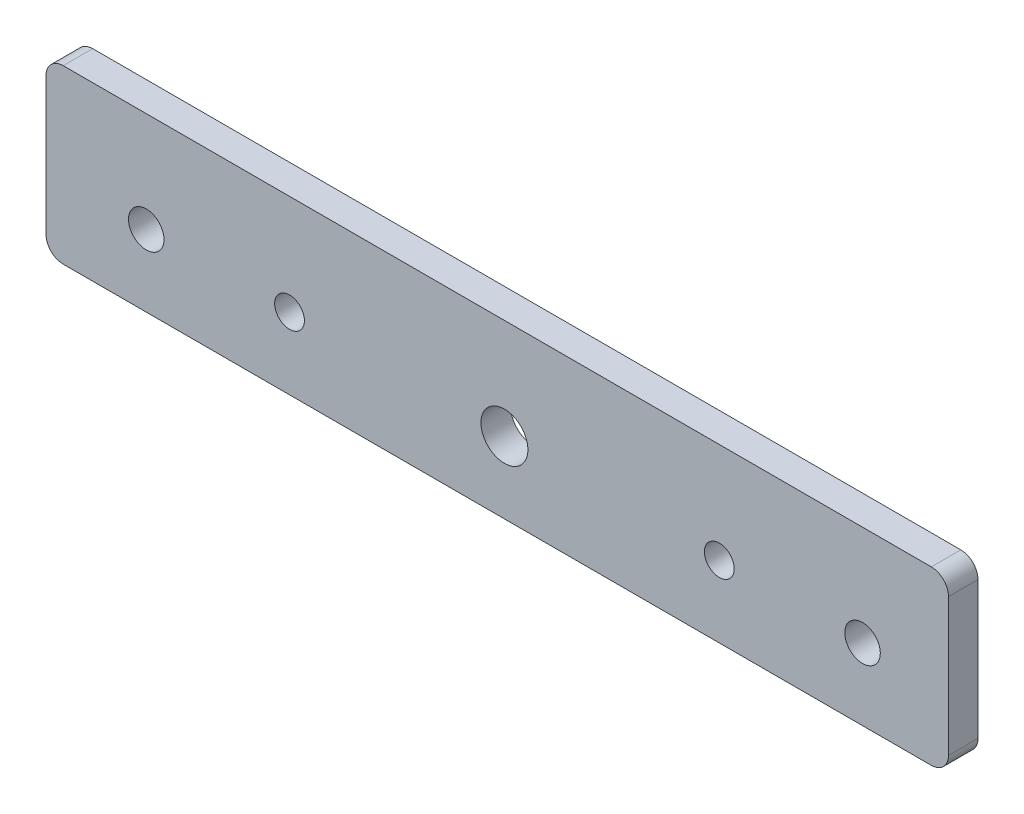
ISO-10303-21;
HEADER;
FILE_DESCRIPTION(('STEP AP214'),'2;1');
FILE_NAME('part.step','',(''),(''),'','','');
FILE_SCHEMA(('AUTOMOTIVE_DESIGN { 1 0 10303 214 1 1 1 1 }'));
ENDSEC;
DATA;
#1=APPLICATION_CONTEXT('core data for automotive mechanical design processes');
#2=APPLICATION_PROTOCOL_DEFINITION('international standard','automotive_design',2000,#1);
#3=PRODUCT_CONTEXT('',#1,'mechanical');
#4=PRODUCT('Part','Part','',(#3));
#5=PRODUCT_RELATED_PRODUCT_CATEGORY('part','',(#4));
#6=PRODUCT_DEFINITION_FORMATION('','',#4);
#7=PRODUCT_DEFINITION_CONTEXT('part definition',#1,'design');
#8=PRODUCT_DEFINITION('design','',#6,#7);
#9=PRODUCT_DEFINITION_SHAPE('','',#8);
#10=(LENGTH_UNIT() NAMED_UNIT(*) SI_UNIT(.MILLI.,.METRE.));
#11=(NAMED_UNIT(*) PLANE_ANGLE_UNIT() SI_UNIT($,.RADIAN.));
#12=(NAMED_UNIT(*) SI_UNIT($,.STERADIAN.) SOLID_ANGLE_UNIT());
#13=UNCERTAINTY_MEASURE_WITH_UNIT(LENGTH_MEASURE(1.E-05),#10,'distance_accuracy_value','');
#14=(GEOMETRIC_REPRESENTATION_CONTEXT(3) GLOBAL_UNCERTAINTY_ASSIGNED_CONTEXT((#13)) GLOBAL_UNIT_ASSIGNED_CONTEXT((#10,
#11,#12)) REPRESENTATION_CONTEXT('',''));
#15=CARTESIAN_POINT('',(0.,0.,0.));
#16=DIRECTION('',(0.,0.,1.));
#17=DIRECTION('',(1.,0.,0.));
#18=AXIS2_PLACEMENT_3D('',#15,#16,#17);
#19=CARTESIAN_POINT('',(0.,17.5,5.15));
#20=DIRECTION('',(0.,1.,0.));
#21=DIRECTION('',(0.,0.,1.));
#22=AXIS2_PLACEMENT_3D('',#19,#20,#21);
#23=PLANE('',#22);
#24=DIRECTION('',(1.,0.,0.));
#25=VECTOR('',#24,1.);
#26=CARTESIAN_POINT('',(0.,17.5,0.));
#27=LINE('',#26,#25);
#28=CARTESIAN_POINT('',(-77.,17.5,0.));
#29=VERTEX_POINT('',#28);
#30=CARTESIAN_POINT('',(74.5,17.5,0.));
#31=VERTEX_POINT('',#30);
#32=EDGE_CURVE('E147',#29,#31,#27,.T.);
#33=ORIENTED_EDGE('',*,*,#32,.F.);
#34=DIRECTION('',(0.,0.,-1.));
#35=VECTOR('',#34,1.);
#36=CARTESIAN_POINT('',(-77.,17.5,5.15));
#37=LINE('',#36,#35);
#38=CARTESIAN_POINT('',(-77.,17.5,5.15));
#39=VERTEX_POINT('',#38);
#40=EDGE_CURVE('E11',#39,#29,#37,.T.);
#41=ORIENTED_EDGE('',*,*,#40,.F.);
#42=DIRECTION('',(1.,0.,0.));
#43=VECTOR('',#42,1.);
#44=CARTESIAN_POINT('',(0.,17.5,5.15));
#45=LINE('',#44,#43);
#46=CARTESIAN_POINT('',(74.5,17.5,5.15));
#47=VERTEX_POINT('',#46);
#48=EDGE_CURVE('E195',#39,#47,#45,.T.);
#49=ORIENTED_EDGE('',*,*,#48,.T.);
#50=DIRECTION('',(0.,0.,-1.));
#51=VECTOR('',#50,1.);
#52=CARTESIAN_POINT('',(74.5,17.5,5.15));
#53=LINE('',#52,#51);
#54=EDGE_CURVE('E88',#47,#31,#53,.T.);
#55=ORIENTED_EDGE('',*,*,#54,.T.);
#56=EDGE_LOOP('',(#33,#41,#49,#55));
#57=FACE_BOUND('',#56,.T.);
#58=ADVANCED_FACE('F37',(#57),#23,.T.);
#59=CARTESIAN_POINT('',(-77.,14.5,5.15));
#60=DIRECTION('',(0.,0.,-1.));
#61=DIRECTION('',(-1.,0.,0.));
#62=AXIS2_PLACEMENT_3D('',#59,#60,#61);
#63=CYLINDRICAL_SURFACE('',#62,3.);
#64=CARTESIAN_POINT('',(-77.,14.5,0.));
#65=DIRECTION('',(0.,0.,1.));
#66=DIRECTION('',(1.,0.,0.));
#67=AXIS2_PLACEMENT_3D('',#64,#65,#66);
#68=CIRCLE('',#67,3.);
#69=CARTESIAN_POINT('',(-80.,14.5,0.));
#70=VERTEX_POINT('',#69);
#71=EDGE_CURVE('E150',#29,#70,#68,.T.);
#72=ORIENTED_EDGE('',*,*,#71,.T.);
#73=DIRECTION('',(0.,0.,-1.));
#74=VECTOR('',#73,1.);
#75=CARTESIAN_POINT('',(-80.,14.5,5.15));
#76=LINE('',#75,#74);
#77=CARTESIAN_POINT('',(-80.,14.5,5.15));
#78=VERTEX_POINT('',#77);
#79=EDGE_CURVE('E46',#78,#70,#76,.T.);
#80=ORIENTED_EDGE('',*,*,#79,.F.);
#81=CARTESIAN_POINT('',(-77.,14.5,5.15));
#82=DIRECTION('',(0.,0.,1.));
#83=DIRECTION('',(1.,0.,0.));
#84=AXIS2_PLACEMENT_3D('',#81,#82,#83);
#85=CIRCLE('',#84,3.);
#86=EDGE_CURVE('E192',#39,#78,#85,.T.);
#87=ORIENTED_EDGE('',*,*,#86,.F.);
#88=ORIENTED_EDGE('',*,*,#40,.T.);
#89=EDGE_LOOP('',(#72,#80,#87,#88));
#90=FACE_BOUND('',#89,.T.);
#91=ADVANCED_FACE('F183',(#90),#63,.T.);
#92=CARTESIAN_POINT('',(-80.,0.,5.15));
#93=DIRECTION('',(-1.,0.,0.));
#94=DIRECTION('',(0.,0.,1.));
#95=AXIS2_PLACEMENT_3D('',#92,#93,#94);
#96=PLANE('',#95);
#97=DIRECTION('',(0.,1.,0.));
#98=VECTOR('',#97,1.);
#99=CARTESIAN_POINT('',(-80.,0.,0.));
#100=LINE('',#99,#98);
#101=CARTESIAN_POINT('',(-80.,-9.5,0.));
#102=VERTEX_POINT('',#101);
#103=EDGE_CURVE('E153',#102,#70,#100,.T.);
#104=ORIENTED_EDGE('',*,*,#103,.F.);
#105=DIRECTION('',(0.,0.,-1.));
#106=VECTOR('',#105,1.);
#107=CARTESIAN_POINT('',(-80.,-9.5,5.15));
#108=LINE('',#107,#106);
#109=CARTESIAN_POINT('',(-80.,-9.5,5.15));
#110=VERTEX_POINT('',#109);
#111=EDGE_CURVE('E173',#110,#102,#108,.T.);
#112=ORIENTED_EDGE('',*,*,#111,.F.);
#113=DIRECTION('',(0.,1.,0.));
#114=VECTOR('',#113,1.);
#115=CARTESIAN_POINT('',(-80.,0.,5.15));
#116=LINE('',#115,#114);
#117=EDGE_CURVE('E180',#110,#78,#116,.T.);
#118=ORIENTED_EDGE('',*,*,#117,.T.);
#119=ORIENTED_EDGE('',*,*,#79,.T.);
#120=EDGE_LOOP('',(#104,#112,#118,#119));
#121=FACE_BOUND('',#120,.T.);
#122=ADVANCED_FACE('F178',(#121),#96,.T.);
#123=CARTESIAN_POINT('',(-77.,-9.5,5.15));
#124=DIRECTION('',(0.,0.,-1.));
#125=DIRECTION('',(-1.,0.,0.));
#126=AXIS2_PLACEMENT_3D('',#123,#124,#125);
#127=CYLINDRICAL_SURFACE('',#126,3.);
#128=CARTESIAN_POINT('',(-77.,-9.5,0.));
#129=DIRECTION('',(0.,0.,1.));
#130=DIRECTION('',(1.,0.,0.));
#131=AXIS2_PLACEMENT_3D('',#128,#129,#130);
#132=CIRCLE('',#131,3.);
#133=CARTESIAN_POINT('',(-77.,-12.5,0.));
#134=VERTEX_POINT('',#133);
#135=EDGE_CURVE('E156',#134,#102,#132,.F.);
#136=ORIENTED_EDGE('',*,*,#135,.F.);
#137=DIRECTION('',(0.,0.,-1.));
#138=VECTOR('',#137,1.);
#139=CARTESIAN_POINT('',(-77.,-12.5,5.15));
#140=LINE('',#139,#138);
#141=CARTESIAN_POINT('',(-77.,-12.5,5.15));
#142=VERTEX_POINT('',#141);
#143=EDGE_CURVE('E171',#142,#134,#140,.T.);
#144=ORIENTED_EDGE('',*,*,#143,.F.);
#145=CARTESIAN_POINT('',(-77.,-9.5,5.15));
#146=DIRECTION('',(0.,0.,1.));
#147=DIRECTION('',(1.,0.,0.));
#148=AXIS2_PLACEMENT_3D('',#145,#146,#147);
#149=CIRCLE('',#148,3.);
#150=EDGE_CURVE('E191',#142,#110,#149,.F.);
#151=ORIENTED_EDGE('',*,*,#150,.T.);
#152=ORIENTED_EDGE('',*,*,#111,.T.);
#153=EDGE_LOOP('',(#136,#144,#151,#152));
#154=FACE_BOUND('',#153,.T.);
#155=ADVANCED_FACE('F189',(#154),#127,.T.);
#156=CARTESIAN_POINT('',(0.,-12.5,5.15));
#157=DIRECTION('',(0.,1.,0.));
#158=DIRECTION('',(0.,0.,1.));
#159=AXIS2_PLACEMENT_3D('',#156,#157,#158);
#160=PLANE('',#159);
#161=DIRECTION('',(1.,0.,0.));
#162=VECTOR('',#161,1.);
#163=CARTESIAN_POINT('',(0.,-12.5,0.));
#164=LINE('',#163,#162);
#165=CARTESIAN_POINT('',(74.5,-12.5,0.));
#166=VERTEX_POINT('',#165);
#167=EDGE_CURVE('E159',#134,#166,#164,.T.);
#168=ORIENTED_EDGE('',*,*,#167,.T.);
#169=DIRECTION('',(0.,0.,-1.));
#170=VECTOR('',#169,1.);
#171=CARTESIAN_POINT('',(74.5,-12.5,5.15));
#172=LINE('',#171,#170);
#173=CARTESIAN_POINT('',(74.5,-12.5,5.15));
#174=VERTEX_POINT('',#173);
#175=EDGE_CURVE('E125',#174,#166,#172,.T.);
#176=ORIENTED_EDGE('',*,*,#175,.F.);
#177=DIRECTION('',(1.,0.,0.));
#178=VECTOR('',#177,1.);
#179=CARTESIAN_POINT('',(0.,-12.5,5.15));
#180=LINE('',#179,#178);
#181=EDGE_CURVE('E113',#142,#174,#180,.T.);
#182=ORIENTED_EDGE('',*,*,#181,.F.);
#183=ORIENTED_EDGE('',*,*,#143,.T.);
#184=EDGE_LOOP('',(#168,#176,#182,#183));
#185=FACE_BOUND('',#184,.T.);
#186=ADVANCED_FACE('F280',(#185),#160,.F.);
#187=CARTESIAN_POINT('',(74.5,-9.5,5.15));
#188=DIRECTION('',(0.,0.,-1.));
#189=DIRECTION('',(-1.,0.,0.));
#190=AXIS2_PLACEMENT_3D('',#187,#188,#189);
#191=CYLINDRICAL_SURFACE('',#190,3.00000000000001);
#192=CARTESIAN_POINT('',(74.5,-9.5,0.));
#193=DIRECTION('',(0.,0.,1.));
#194=DIRECTION('',(1.,0.,0.));
#195=AXIS2_PLACEMENT_3D('',#192,#193,#194);
#196=CIRCLE('',#195,3.00000000000001);
#197=CARTESIAN_POINT('',(77.5,-9.5,0.));
#198=VERTEX_POINT('',#197);
#199=EDGE_CURVE('E121',#166,#198,#196,.T.);
#200=ORIENTED_EDGE('',*,*,#199,.T.);
#201=DIRECTION('',(0.,0.,-1.));
#202=VECTOR('',#201,1.);
#203=CARTESIAN_POINT('',(77.5,-9.5,5.15));
#204=LINE('',#203,#202);
#205=CARTESIAN_POINT('',(77.5,-9.5,5.15));
#206=VERTEX_POINT('',#205);
#207=EDGE_CURVE('E119',#206,#198,#204,.T.);
#208=ORIENTED_EDGE('',*,*,#207,.F.);
#209=CARTESIAN_POINT('',(74.5,-9.5,5.15));
#210=DIRECTION('',(0.,0.,1.));
#211=DIRECTION('',(1.,0.,0.));
#212=AXIS2_PLACEMENT_3D('',#209,#210,#211);
#213=CIRCLE('',#212,3.00000000000001);
#214=EDGE_CURVE('E106',#174,#206,#213,.T.);
#215=ORIENTED_EDGE('',*,*,#214,.F.);
#216=ORIENTED_EDGE('',*,*,#175,.T.);
#217=EDGE_LOOP('',(#200,#208,#215,#216));
#218=FACE_BOUND('',#217,.T.);
#219=ADVANCED_FACE('F120',(#218),#191,.T.);
#220=CARTESIAN_POINT('',(77.5,0.,5.15));
#221=DIRECTION('',(1.,0.,0.));
#222=DIRECTION('',(0.,0.,-1.));
#223=AXIS2_PLACEMENT_3D('',#220,#221,#222);
#224=PLANE('',#223);
#225=DIRECTION('',(0.,-1.,0.));
#226=VECTOR('',#225,1.);
#227=CARTESIAN_POINT('',(77.5,0.,0.));
#228=LINE('',#227,#226);
#229=CARTESIAN_POINT('',(77.5,14.5,0.));
#230=VERTEX_POINT('',#229);
#231=EDGE_CURVE('E163',#230,#198,#228,.T.);
#232=ORIENTED_EDGE('',*,*,#231,.F.);
#233=DIRECTION('',(0.,0.,-1.));
#234=VECTOR('',#233,1.);
#235=CARTESIAN_POINT('',(77.5,14.5,5.15));
#236=LINE('',#235,#234);
#237=CARTESIAN_POINT('',(77.5,14.5,5.15));
#238=VERTEX_POINT('',#237);
#239=EDGE_CURVE('E81',#238,#230,#236,.T.);
#240=ORIENTED_EDGE('',*,*,#239,.F.);
#241=DIRECTION('',(0.,-1.,0.));
#242=VECTOR('',#241,1.);
#243=CARTESIAN_POINT('',(77.5,0.,5.15));
#244=LINE('',#243,#242);
#245=EDGE_CURVE('E110',#238,#206,#244,.T.);
#246=ORIENTED_EDGE('',*,*,#245,.T.);
#247=ORIENTED_EDGE('',*,*,#207,.T.);
#248=EDGE_LOOP('',(#232,#240,#246,#247));
#249=FACE_BOUND('',#248,.T.);
#250=ADVANCED_FACE('F127',(#249),#224,.T.);
#251=CARTESIAN_POINT('',(0.,0.,5.15));
#252=DIRECTION('',(0.,0.,-1.));
#253=DIRECTION('',(-1.,0.,0.));
#254=AXIS2_PLACEMENT_3D('',#251,#252,#253);
#255=CYLINDRICAL_SURFACE('',#254,4.1);
#256=CARTESIAN_POINT('',(0.,0.,5.15));
#257=DIRECTION('',(0.,0.,1.));
#258=DIRECTION('',(1.,0.,0.));
#259=AXIS2_PLACEMENT_3D('',#256,#257,#258);
#260=CIRCLE('',#259,4.1);
#261=CARTESIAN_POINT('',(4.1,0.,5.15));
#262=VERTEX_POINT('',#261);
#263=EDGE_CURVE('E199',#262,#262,#260,.T.);
#264=ORIENTED_EDGE('',*,*,#263,.T.);
#265=EDGE_LOOP('',(#264));
#266=FACE_BOUND('',#265,.T.);
#267=CARTESIAN_POINT('',(0.,0.,0.));
#268=DIRECTION('',(0.,0.,1.));
#269=DIRECTION('',(1.,0.,0.));
#270=AXIS2_PLACEMENT_3D('',#267,#268,#269);
#271=CIRCLE('',#270,4.1);
#272=CARTESIAN_POINT('',(4.1,0.,0.));
#273=VERTEX_POINT('',#272);
#274=EDGE_CURVE('E144',#273,#273,#271,.T.);
#275=ORIENTED_EDGE('',*,*,#274,.F.);
#276=EDGE_LOOP('',(#275));
#277=FACE_BOUND('',#276,.T.);
#278=ADVANCED_FACE('F228',(#266,#277),#255,.F.);
#279=CARTESIAN_POINT('',(62.5,0.,5.15));
#280=DIRECTION('',(0.,0.,-1.));
#281=DIRECTION('',(-1.,0.,0.));
#282=AXIS2_PLACEMENT_3D('',#279,#280,#281);
#283=CYLINDRICAL_SURFACE('',#282,3.1);
#284=CARTESIAN_POINT('',(62.5,0.,5.15));
#285=DIRECTION('',(0.,0.,1.));
#286=DIRECTION('',(1.,0.,0.));
#287=AXIS2_PLACEMENT_3D('',#284,#285,#286);
#288=CIRCLE('',#287,3.1);
#289=CARTESIAN_POINT('',(65.6,0.,5.15));
#290=VERTEX_POINT('',#289);
#291=EDGE_CURVE('E202',#290,#290,#288,.T.);
#292=ORIENTED_EDGE('',*,*,#291,.T.);
#293=EDGE_LOOP('',(#292));
#294=FACE_BOUND('',#293,.T.);
#295=CARTESIAN_POINT('',(62.5,0.,0.));
#296=DIRECTION('',(0.,0.,1.));
#297=DIRECTION('',(1.,0.,0.));
#298=AXIS2_PLACEMENT_3D('',#295,#296,#297);
#299=CIRCLE('',#298,3.1);
#300=CARTESIAN_POINT('',(65.6,0.,0.));
#301=VERTEX_POINT('',#300);
#302=EDGE_CURVE('E141',#301,#301,#299,.T.);
#303=ORIENTED_EDGE('',*,*,#302,.F.);
#304=EDGE_LOOP('',(#303));
#305=FACE_BOUND('',#304,.T.);
#306=ADVANCED_FACE('F231',(#294,#305),#283,.F.);
#307=CARTESIAN_POINT('',(-62.5,0.,5.15));
#308=DIRECTION('',(0.,0.,-1.));
#309=DIRECTION('',(-1.,0.,0.));
#310=AXIS2_PLACEMENT_3D('',#307,#308,#309);
#311=CYLINDRICAL_SURFACE('',#310,3.1);
#312=CARTESIAN_POINT('',(-62.5,0.,5.15));
#313=DIRECTION('',(0.,0.,1.));
#314=DIRECTION('',(1.,0.,0.));
#315=AXIS2_PLACEMENT_3D('',#312,#313,#314);
#316=CIRCLE('',#315,3.1);
#317=CARTESIAN_POINT('',(-59.4,0.,5.15));
#318=VERTEX_POINT('',#317);
#319=EDGE_CURVE('E205',#318,#318,#316,.T.);
#320=ORIENTED_EDGE('',*,*,#319,.T.);
#321=EDGE_LOOP('',(#320));
#322=FACE_BOUND('',#321,.T.);
#323=CARTESIAN_POINT('',(-62.5,0.,0.));
#324=DIRECTION('',(0.,0.,1.));
#325=DIRECTION('',(1.,0.,0.));
#326=AXIS2_PLACEMENT_3D('',#323,#324,#325);
#327=CIRCLE('',#326,3.1);
#328=CARTESIAN_POINT('',(-59.4,0.,0.));
#329=VERTEX_POINT('',#328);
#330=EDGE_CURVE('E138',#329,#329,#327,.T.);
#331=ORIENTED_EDGE('',*,*,#330,.F.);
#332=EDGE_LOOP('',(#331));
#333=FACE_BOUND('',#332,.T.);
#334=ADVANCED_FACE('F252',(#322,#333),#311,.F.);
#335=CARTESIAN_POINT('',(37.5,0.,5.15));
#336=DIRECTION('',(0.,0.,-1.));
#337=DIRECTION('',(-1.,0.,0.));
#338=AXIS2_PLACEMENT_3D('',#335,#336,#337);
#339=CYLINDRICAL_SURFACE('',#338,2.6);
#340=CARTESIAN_POINT('',(37.5,0.,5.15));
#341=DIRECTION('',(0.,0.,1.));
#342=DIRECTION('',(1.,0.,0.));
#343=AXIS2_PLACEMENT_3D('',#340,#341,#342);
#344=CIRCLE('',#343,2.6);
#345=CARTESIAN_POINT('',(40.1,0.,5.15));
#346=VERTEX_POINT('',#345);
#347=EDGE_CURVE('E208',#346,#346,#344,.T.);
#348=ORIENTED_EDGE('',*,*,#347,.T.);
#349=EDGE_LOOP('',(#348));
#350=FACE_BOUND('',#349,.T.);
#351=CARTESIAN_POINT('',(37.5,0.,0.));
#352=DIRECTION('',(0.,0.,1.));
#353=DIRECTION('',(1.,0.,0.));
#354=AXIS2_PLACEMENT_3D('',#351,#352,#353);
#355=CIRCLE('',#354,2.6);
#356=CARTESIAN_POINT('',(40.1,0.,0.));
#357=VERTEX_POINT('',#356);
#358=EDGE_CURVE('E135',#357,#357,#355,.T.);
#359=ORIENTED_EDGE('',*,*,#358,.F.);
#360=EDGE_LOOP('',(#359));
#361=FACE_BOUND('',#360,.T.);
#362=ADVANCED_FACE('F255',(#350,#361),#339,.F.);
#363=CARTESIAN_POINT('',(-37.5,0.,5.15));
#364=DIRECTION('',(0.,0.,-1.));
#365=DIRECTION('',(-1.,0.,0.));
#366=AXIS2_PLACEMENT_3D('',#363,#364,#365);
#367=CYLINDRICAL_SURFACE('',#366,2.6);
#368=CARTESIAN_POINT('',(-37.5,0.,5.15));
#369=DIRECTION('',(0.,0.,1.));
#370=DIRECTION('',(1.,0.,0.));
#371=AXIS2_PLACEMENT_3D('',#368,#369,#370);
#372=CIRCLE('',#371,2.6);
#373=CARTESIAN_POINT('',(-34.9,0.,5.15));
#374=VERTEX_POINT('',#373);
#375=EDGE_CURVE('E167',#374,#374,#372,.T.);
#376=ORIENTED_EDGE('',*,*,#375,.T.);
#377=EDGE_LOOP('',(#376));
#378=FACE_BOUND('',#377,.T.);
#379=CARTESIAN_POINT('',(-37.5,0.,0.));
#380=DIRECTION('',(0.,0.,1.));
#381=DIRECTION('',(1.,0.,0.));
#382=AXIS2_PLACEMENT_3D('',#379,#380,#381);
#383=CIRCLE('',#382,2.6);
#384=CARTESIAN_POINT('',(-34.9,0.,0.));
#385=VERTEX_POINT('',#384);
#386=EDGE_CURVE('E132',#385,#385,#383,.T.);
#387=ORIENTED_EDGE('',*,*,#386,.F.);
#388=EDGE_LOOP('',(#387));
#389=FACE_BOUND('',#388,.T.);
#390=ADVANCED_FACE('F39',(#378,#389),#367,.F.);
#391=CARTESIAN_POINT('',(74.5,14.5,5.15));
#392=DIRECTION('',(0.,0.,-1.));
#393=DIRECTION('',(-1.,0.,0.));
#394=AXIS2_PLACEMENT_3D('',#391,#392,#393);
#395=CYLINDRICAL_SURFACE('',#394,3.00000000000001);
#396=CARTESIAN_POINT('',(74.5,14.5,0.));
#397=DIRECTION('',(0.,0.,1.));
#398=DIRECTION('',(1.,0.,0.));
#399=AXIS2_PLACEMENT_3D('',#396,#397,#398);
#400=CIRCLE('',#399,3.00000000000001);
#401=EDGE_CURVE('E165',#230,#31,#400,.T.);
#402=ORIENTED_EDGE('',*,*,#401,.T.);
#403=ORIENTED_EDGE('',*,*,#54,.F.);
#404=CARTESIAN_POINT('',(74.5,14.5,5.15));
#405=DIRECTION('',(0.,0.,1.));
#406=DIRECTION('',(1.,0.,0.));
#407=AXIS2_PLACEMENT_3D('',#404,#405,#406);
#408=CIRCLE('',#407,3.00000000000001);
#409=EDGE_CURVE('E54',#238,#47,#408,.T.);
#410=ORIENTED_EDGE('',*,*,#409,.F.);
#411=ORIENTED_EDGE('',*,*,#239,.T.);
#412=EDGE_LOOP('',(#402,#403,#410,#411));
#413=FACE_BOUND('',#412,.T.);
#414=ADVANCED_FACE('F218',(#413),#395,.T.);
#415=CARTESIAN_POINT('',(0.,0.,5.15));
#416=DIRECTION('',(0.,0.,1.));
#417=DIRECTION('',(1.,0.,0.));
#418=AXIS2_PLACEMENT_3D('',#415,#416,#417);
#419=PLANE('',#418);
#420=ORIENTED_EDGE('',*,*,#375,.F.);
#421=EDGE_LOOP('',(#420));
#422=FACE_BOUND('',#421,.T.);
#423=ORIENTED_EDGE('',*,*,#347,.F.);
#424=EDGE_LOOP('',(#423));
#425=FACE_BOUND('',#424,.T.);
#426=ORIENTED_EDGE('',*,*,#319,.F.);
#427=EDGE_LOOP('',(#426));
#428=FACE_BOUND('',#427,.T.);
#429=ORIENTED_EDGE('',*,*,#291,.F.);
#430=EDGE_LOOP('',(#429));
#431=FACE_BOUND('',#430,.T.);
#432=ORIENTED_EDGE('',*,*,#263,.F.);
#433=EDGE_LOOP('',(#432));
#434=FACE_BOUND('',#433,.T.);
#435=ORIENTED_EDGE('',*,*,#48,.F.);
#436=ORIENTED_EDGE('',*,*,#86,.T.);
#437=ORIENTED_EDGE('',*,*,#117,.F.);
#438=ORIENTED_EDGE('',*,*,#150,.F.);
#439=ORIENTED_EDGE('',*,*,#181,.T.);
#440=ORIENTED_EDGE('',*,*,#214,.T.);
#441=ORIENTED_EDGE('',*,*,#245,.F.);
#442=ORIENTED_EDGE('',*,*,#409,.T.);
#443=EDGE_LOOP('',(#435,#436,#437,#438,#439,#440,#441,#442));
#444=FACE_BOUND('',#443,.T.);
#445=ADVANCED_FACE('F108',(#422,#425,#428,#431,#434,#444),#419,.T.);
#446=CARTESIAN_POINT('',(0.,0.,0.));
#447=DIRECTION('',(0.,0.,1.));
#448=DIRECTION('',(1.,0.,0.));
#449=AXIS2_PLACEMENT_3D('',#446,#447,#448);
#450=PLANE('',#449);
#451=ORIENTED_EDGE('',*,*,#386,.T.);
#452=EDGE_LOOP('',(#451));
#453=FACE_BOUND('',#452,.T.);
#454=ORIENTED_EDGE('',*,*,#358,.T.);
#455=EDGE_LOOP('',(#454));
#456=FACE_BOUND('',#455,.T.);
#457=ORIENTED_EDGE('',*,*,#330,.T.);
#458=EDGE_LOOP('',(#457));
#459=FACE_BOUND('',#458,.T.);
#460=ORIENTED_EDGE('',*,*,#302,.T.);
#461=EDGE_LOOP('',(#460));
#462=FACE_BOUND('',#461,.T.);
#463=ORIENTED_EDGE('',*,*,#274,.T.);
#464=EDGE_LOOP('',(#463));
#465=FACE_BOUND('',#464,.T.);
#466=ORIENTED_EDGE('',*,*,#32,.T.);
#467=ORIENTED_EDGE('',*,*,#401,.F.);
#468=ORIENTED_EDGE('',*,*,#231,.T.);
#469=ORIENTED_EDGE('',*,*,#199,.F.);
#470=ORIENTED_EDGE('',*,*,#167,.F.);
#471=ORIENTED_EDGE('',*,*,#135,.T.);
#472=ORIENTED_EDGE('',*,*,#103,.T.);
#473=ORIENTED_EDGE('',*,*,#71,.F.);
#474=EDGE_LOOP('',(#466,#467,#468,#469,#470,#471,#472,#473));
#475=FACE_BOUND('',#474,.T.);
#476=ADVANCED_FACE('F185',(#453,#456,#459,#462,#465,#475),#450,.F.);
#477=CLOSED_SHELL('',(#58,#91,#122,#155,#186,#219,#250,#278,#306,#334,#362,#390,#414,#445,#476));
#478=MANIFOLD_SOLID_BREP('B2',#477);
#479=ADVANCED_BREP_SHAPE_REPRESENTATION('',(#18,#478),#14);
#480=SHAPE_DEFINITION_REPRESENTATION(#9,#479);
ENDSEC;
END-ISO-10303-21;
